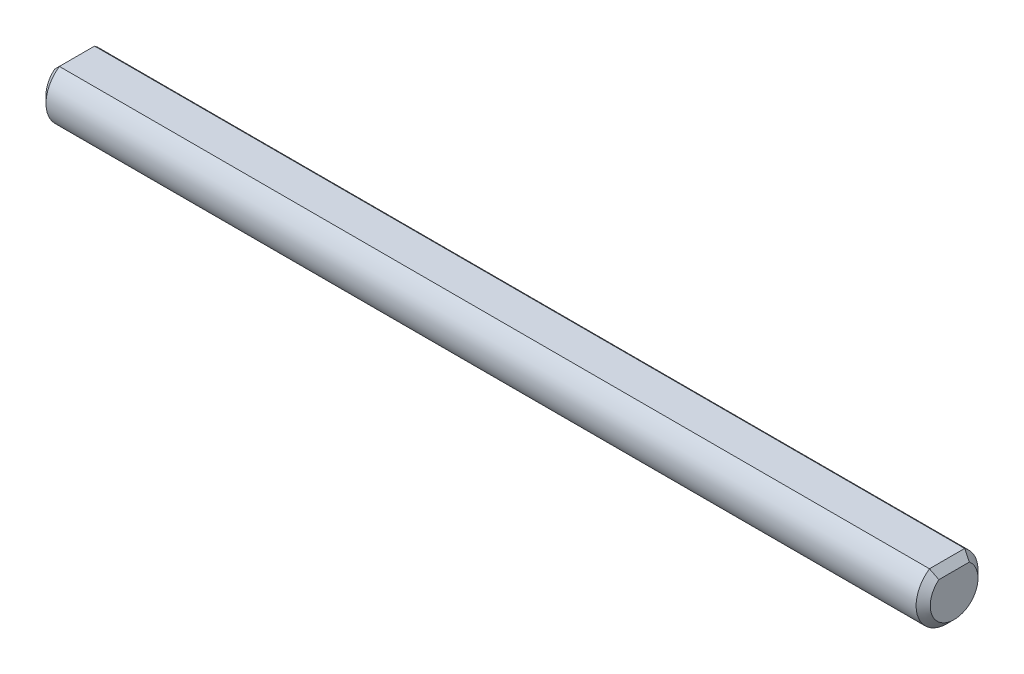
ISO-10303-21;
HEADER;
FILE_DESCRIPTION(('STEP AP214'),'2;1');
FILE_NAME('part.step','',(''),(''),'','','');
FILE_SCHEMA(('AUTOMOTIVE_DESIGN { 1 0 10303 214 1 1 1 1 }'));
ENDSEC;
DATA;
#1=APPLICATION_CONTEXT('core data for automotive mechanical design processes');
#2=APPLICATION_PROTOCOL_DEFINITION('international standard','automotive_design',2000,#1);
#3=PRODUCT_CONTEXT('',#1,'mechanical');
#4=PRODUCT('Part','Part','',(#3));
#5=PRODUCT_RELATED_PRODUCT_CATEGORY('part','',(#4));
#6=PRODUCT_DEFINITION_FORMATION('','',#4);
#7=PRODUCT_DEFINITION_CONTEXT('part definition',#1,'design');
#8=PRODUCT_DEFINITION('design','',#6,#7);
#9=PRODUCT_DEFINITION_SHAPE('','',#8);
#10=(LENGTH_UNIT() NAMED_UNIT(*) SI_UNIT(.MILLI.,.METRE.));
#11=(NAMED_UNIT(*) PLANE_ANGLE_UNIT() SI_UNIT($,.RADIAN.));
#12=(NAMED_UNIT(*) SI_UNIT($,.STERADIAN.) SOLID_ANGLE_UNIT());
#13=UNCERTAINTY_MEASURE_WITH_UNIT(LENGTH_MEASURE(1.E-05),#10,'distance_accuracy_value','');
#14=(GEOMETRIC_REPRESENTATION_CONTEXT(3) GLOBAL_UNCERTAINTY_ASSIGNED_CONTEXT((#13)) GLOBAL_UNIT_ASSIGNED_CONTEXT((#10,
#11,#12)) REPRESENTATION_CONTEXT('',''));
#15=CARTESIAN_POINT('',(0.,0.,0.));
#16=DIRECTION('',(0.,0.,1.));
#17=DIRECTION('',(1.,0.,0.));
#18=AXIS2_PLACEMENT_3D('',#15,#16,#17);
#19=CARTESIAN_POINT('',(25.,0.,0.));
#20=DIRECTION('',(-1.,0.,0.));
#21=DIRECTION('',(0.,0.,1.));
#22=AXIS2_PLACEMENT_3D('',#19,#20,#21);
#23=CYLINDRICAL_SURFACE('',#22,1.75);
#24=DIRECTION('',(-1.,0.,0.));
#25=VECTOR('',#24,1.);
#26=CARTESIAN_POINT('',(25.,1.43923133145753,0.995546671206827));
#27=LINE('',#26,#25);
#28=CARTESIAN_POINT('',(24.6,1.43923133145753,0.995546671206827));
#29=VERTEX_POINT('',#28);
#30=CARTESIAN_POINT('',(-24.6,1.43923133145753,0.995546671206827));
#31=VERTEX_POINT('',#30);
#32=EDGE_CURVE('E89',#29,#31,#27,.T.);
#33=ORIENTED_EDGE('',*,*,#32,.T.);
#34=CARTESIAN_POINT('',(-24.6,0.,0.));
#35=DIRECTION('',(1.,0.,0.));
#36=DIRECTION('',(0.,0.,-1.));
#37=AXIS2_PLACEMENT_3D('',#34,#35,#36);
#38=CIRCLE('',#37,1.75);
#39=CARTESIAN_POINT('',(-24.6,1.43923133145753,-0.995546671206827));
#40=VERTEX_POINT('',#39);
#41=EDGE_CURVE('E94',#31,#40,#38,.T.);
#42=ORIENTED_EDGE('',*,*,#41,.T.);
#43=DIRECTION('',(-1.,0.,0.));
#44=VECTOR('',#43,1.);
#45=CARTESIAN_POINT('',(25.,1.43923133145753,-0.995546671206827));
#46=LINE('',#45,#44);
#47=CARTESIAN_POINT('',(24.6,1.43923133145753,-0.995546671206827));
#48=VERTEX_POINT('',#47);
#49=EDGE_CURVE('E91',#48,#40,#46,.T.);
#50=ORIENTED_EDGE('',*,*,#49,.F.);
#51=CARTESIAN_POINT('',(24.6,0.,0.));
#52=DIRECTION('',(1.,0.,0.));
#53=DIRECTION('',(0.,0.,-1.));
#54=AXIS2_PLACEMENT_3D('',#51,#52,#53);
#55=CIRCLE('',#54,1.75);
#56=EDGE_CURVE('E87',#48,#29,#55,.F.);
#57=ORIENTED_EDGE('',*,*,#56,.T.);
#58=EDGE_LOOP('',(#33,#42,#50,#57));
#59=FACE_BOUND('',#58,.T.);
#60=ADVANCED_FACE('F37',(#59),#23,.T.);
#61=CARTESIAN_POINT('',(25.,1.43923133145753,-0.995546671206827));
#62=DIRECTION('',(0.,-1.,0.));
#63=DIRECTION('',(0.,0.,-1.));
#64=AXIS2_PLACEMENT_3D('',#61,#62,#63);
#65=PLANE('',#64);
#66=ORIENTED_EDGE('',*,*,#49,.T.);
#67=DIRECTION('',(0.,0.,1.));
#68=VECTOR('',#67,1.);
#69=CARTESIAN_POINT('',(-24.6,1.43923133145753,-0.995546671206827));
#70=LINE('',#69,#68);
#71=EDGE_CURVE('E102',#40,#31,#70,.T.);
#72=ORIENTED_EDGE('',*,*,#71,.T.);
#73=ORIENTED_EDGE('',*,*,#32,.F.);
#74=DIRECTION('',(0.,0.,-1.));
#75=VECTOR('',#74,1.);
#76=CARTESIAN_POINT('',(24.6,1.43923133145753,-0.995546671206827));
#77=LINE('',#76,#75);
#78=EDGE_CURVE('E100',#29,#48,#77,.T.);
#79=ORIENTED_EDGE('',*,*,#78,.T.);
#80=EDGE_LOOP('',(#66,#72,#73,#79));
#81=FACE_BOUND('',#80,.T.);
#82=ADVANCED_FACE('F99',(#81),#65,.F.);
#83=CARTESIAN_POINT('',(25.,0.,0.));
#84=DIRECTION('',(1.,0.,0.));
#85=DIRECTION('',(0.,0.,-1.));
#86=AXIS2_PLACEMENT_3D('',#83,#84,#85);
#87=PLANE('',#86);
#88=CARTESIAN_POINT('',(25.,0.,0.));
#89=DIRECTION('',(1.,0.,0.));
#90=DIRECTION('',(0.,0.,-1.));
#91=AXIS2_PLACEMENT_3D('',#88,#89,#90);
#92=CIRCLE('',#91,1.35);
#93=CARTESIAN_POINT('',(25.,1.03923133145753,0.861683375560314));
#94=VERTEX_POINT('',#93);
#95=CARTESIAN_POINT('',(25.,1.03923133145753,-0.861683375560314));
#96=VERTEX_POINT('',#95);
#97=EDGE_CURVE('E52',#94,#96,#92,.T.);
#98=ORIENTED_EDGE('',*,*,#97,.T.);
#99=DIRECTION('',(0.,0.,1.));
#100=VECTOR('',#99,1.);
#101=CARTESIAN_POINT('',(25.,1.03923133145753,0.995546671206827));
#102=LINE('',#101,#100);
#103=EDGE_CURVE('E11',#96,#94,#102,.T.);
#104=ORIENTED_EDGE('',*,*,#103,.T.);
#105=EDGE_LOOP('',(#98,#104));
#106=FACE_BOUND('',#105,.T.);
#107=ADVANCED_FACE('F159',(#106),#87,.T.);
#108=CARTESIAN_POINT('',(-25.,0.,0.));
#109=DIRECTION('',(1.,0.,0.));
#110=DIRECTION('',(0.,0.,-1.));
#111=AXIS2_PLACEMENT_3D('',#108,#109,#110);
#112=PLANE('',#111);
#113=CARTESIAN_POINT('',(-25.,0.,0.));
#114=DIRECTION('',(1.,0.,0.));
#115=DIRECTION('',(0.,0.,-1.));
#116=AXIS2_PLACEMENT_3D('',#113,#114,#115);
#117=CIRCLE('',#116,1.34999999999999);
#118=CARTESIAN_POINT('',(-25.,1.03923133145752,-0.861683375560309));
#119=VERTEX_POINT('',#118);
#120=CARTESIAN_POINT('',(-25.,1.03923133145752,0.861683375560309));
#121=VERTEX_POINT('',#120);
#122=EDGE_CURVE('E147',#119,#121,#117,.F.);
#123=ORIENTED_EDGE('',*,*,#122,.T.);
#124=DIRECTION('',(0.,0.,-1.));
#125=VECTOR('',#124,1.);
#126=CARTESIAN_POINT('',(-25.,1.03923133145752,0.));
#127=LINE('',#126,#125);
#128=EDGE_CURVE('E95',#121,#119,#127,.T.);
#129=ORIENTED_EDGE('',*,*,#128,.T.);
#130=EDGE_LOOP('',(#123,#129));
#131=FACE_BOUND('',#130,.T.);
#132=ADVANCED_FACE('F157',(#131),#112,.F.);
#133=CARTESIAN_POINT('',(-24.6,0.,0.));
#134=DIRECTION('',(1.,0.,0.));
#135=DIRECTION('',(0.,0.,-1.));
#136=AXIS2_PLACEMENT_3D('',#133,#134,#135);
#137=CONICAL_SURFACE('',#136,1.75,0.785398163397446);
#138=CARTESIAN_POINT('',(-24.6,1.43923133145753,0.995546671206827));
#139=CARTESIAN_POINT('',(-24.6334507451215,1.40578058633598,0.985103875700533));
#140=CARTESIAN_POINT('',(-24.666877458675,1.37235387278255,0.974505988646356));
#141=CARTESIAN_POINT('',(-24.7336732743098,1.30555805714769,0.95296727222749));
#142=CARTESIAN_POINT('',(-24.7670423800024,1.27218895145513,0.942026465247995));
#143=CARTESIAN_POINT('',(-24.8337184630385,1.20551286841906,0.919767573801417));
#144=CARTESIAN_POINT('',(-24.8670254391172,1.17220589234028,0.908449481740782));
#145=CARTESIAN_POINT('',(-24.9335687513942,1.10566258006333,0.885392563202528));
#146=CARTESIAN_POINT('',(-24.9668050828438,1.07242624861377,0.873653709333867));
#147=CARTESIAN_POINT('',(-25.,1.03923133145752,0.861683375560309));
#148=B_SPLINE_CURVE_WITH_KNOTS('',3,(#138,#139,#140,#141,#142,#143,#144,#145,#146,#147),
.UNSPECIFIED.,.F.,.F.,(4,2,2,2,4),(0.,0.145336284535562,0.290663101459312,0.435992845118985,
0.581332066798329),.UNSPECIFIED.);
#149=EDGE_CURVE('E107',#121,#31,#148,.F.);
#150=ORIENTED_EDGE('',*,*,#149,.F.);
#151=ORIENTED_EDGE('',*,*,#122,.F.);
#152=CARTESIAN_POINT('',(-25.,1.03923133145752,-0.861683375560309));
#153=CARTESIAN_POINT('',(-24.9668050828438,1.07242624861377,-0.873653709333867));
#154=CARTESIAN_POINT('',(-24.9335687513942,1.10566258006333,-0.885392563202528));
#155=CARTESIAN_POINT('',(-24.8670254391172,1.17220589234028,-0.908449481740782));
#156=CARTESIAN_POINT('',(-24.8337184630385,1.20551286841906,-0.919767573801417));
#157=CARTESIAN_POINT('',(-24.7670423800024,1.27218895145513,-0.942026465247995));
#158=CARTESIAN_POINT('',(-24.7336732743098,1.30555805714769,-0.95296727222749));
#159=CARTESIAN_POINT('',(-24.666877458675,1.37235387278255,-0.974505988646357));
#160=CARTESIAN_POINT('',(-24.6334507451215,1.40578058633598,-0.985103875700534));
#161=CARTESIAN_POINT('',(-24.6,1.43923133145753,-0.995546671206827));
#162=B_SPLINE_CURVE_WITH_KNOTS('',3,(#152,#153,#154,#155,#156,#157,#158,#159,#160,#161),
.UNSPECIFIED.,.F.,.F.,(4,2,2,2,4),(0.,0.145339221679344,0.290668965339016,0.435995782262767,
0.58133206679833),.UNSPECIFIED.);
#163=EDGE_CURVE('E103',#40,#119,#162,.F.);
#164=ORIENTED_EDGE('',*,*,#163,.F.);
#165=ORIENTED_EDGE('',*,*,#41,.F.);
#166=EDGE_LOOP('',(#150,#151,#164,#165));
#167=FACE_BOUND('',#166,.T.);
#168=ADVANCED_FACE('F133',(#167),#137,.T.);
#169=CARTESIAN_POINT('',(-24.6,1.43923133145753,-0.995546671206827));
#170=DIRECTION('',(0.707106781186546,-0.707106781186549,0.));
#171=DIRECTION('',(0.,0.,1.));
#172=AXIS2_PLACEMENT_3D('',#169,#170,#171);
#173=PLANE('',#172);
#174=ORIENTED_EDGE('',*,*,#163,.T.);
#175=ORIENTED_EDGE('',*,*,#128,.F.);
#176=ORIENTED_EDGE('',*,*,#149,.T.);
#177=ORIENTED_EDGE('',*,*,#71,.F.);
#178=EDGE_LOOP('',(#174,#175,#176,#177));
#179=FACE_BOUND('',#178,.T.);
#180=ADVANCED_FACE('F125',(#179),#173,.F.);
#181=CARTESIAN_POINT('',(25.,0.,0.));
#182=DIRECTION('',(-1.,0.,0.));
#183=DIRECTION('',(0.,0.,1.));
#184=AXIS2_PLACEMENT_3D('',#181,#182,#183);
#185=CONICAL_SURFACE('',#184,1.35,0.785398163397451);
#186=CARTESIAN_POINT('',(25.,1.03923133145753,0.861683375560314));
#187=CARTESIAN_POINT('',(24.9668050828438,1.07242624861378,0.873653709333872));
#188=CARTESIAN_POINT('',(24.9335687513942,1.10566258006334,0.885392563202532));
#189=CARTESIAN_POINT('',(24.8670254391172,1.17220589234029,0.908449481740786));
#190=CARTESIAN_POINT('',(24.8337184630385,1.20551286841906,0.91976757380142));
#191=CARTESIAN_POINT('',(24.7670423800024,1.27218895145513,0.942026465247997));
#192=CARTESIAN_POINT('',(24.7336732743098,1.30555805714769,0.952967272227492));
#193=CARTESIAN_POINT('',(24.666877458675,1.37235387278255,0.974505988646357));
#194=CARTESIAN_POINT('',(24.6334507451216,1.40578058633598,0.985103875700534));
#195=CARTESIAN_POINT('',(24.6,1.43923133145753,0.995546671206827));
#196=B_SPLINE_CURVE_WITH_KNOTS('',3,(#186,#187,#188,#189,#190,#191,#192,#193,#194,#195),
.UNSPECIFIED.,.F.,.F.,(4,2,2,2,4),(0.,0.145339221679339,0.290668965339007,0.435995782262749,
0.581332066798307),.UNSPECIFIED.);
#197=EDGE_CURVE('E65',#29,#94,#196,.F.);
#198=ORIENTED_EDGE('',*,*,#197,.F.);
#199=ORIENTED_EDGE('',*,*,#56,.F.);
#200=CARTESIAN_POINT('',(24.6,1.43923133145753,-0.995546671206827));
#201=CARTESIAN_POINT('',(24.6334507451216,1.40578058633598,-0.985103875700534));
#202=CARTESIAN_POINT('',(24.666877458675,1.37235387278255,-0.974505988646357));
#203=CARTESIAN_POINT('',(24.7336732743098,1.30555805714769,-0.952967272227491));
#204=CARTESIAN_POINT('',(24.7670423800024,1.27218895145513,-0.942026465247997));
#205=CARTESIAN_POINT('',(24.8337184630385,1.20551286841906,-0.919767573801419));
#206=CARTESIAN_POINT('',(24.8670254391172,1.17220589234029,-0.908449481740785));
#207=CARTESIAN_POINT('',(24.9335687513942,1.10566258006334,-0.885392563202532));
#208=CARTESIAN_POINT('',(24.9668050828438,1.07242624861378,-0.873653709333872));
#209=CARTESIAN_POINT('',(25.,1.03923133145753,-0.861683375560314));
#210=B_SPLINE_CURVE_WITH_KNOTS('',3,(#200,#201,#202,#203,#204,#205,#206,#207,#208,#209),
.UNSPECIFIED.,.F.,.F.,(4,2,2,2,4),(0.,0.145336284535557,0.290663101459299,0.435992845118967,
0.581332066798306),.UNSPECIFIED.);
#211=EDGE_CURVE('E43',#96,#48,#210,.F.);
#212=ORIENTED_EDGE('',*,*,#211,.F.);
#213=ORIENTED_EDGE('',*,*,#97,.F.);
#214=EDGE_LOOP('',(#198,#199,#212,#213));
#215=FACE_BOUND('',#214,.T.);
#216=ADVANCED_FACE('F106',(#215),#185,.T.);
#217=CARTESIAN_POINT('',(25.,1.03923133145753,0.));
#218=DIRECTION('',(0.707106781186549,0.707106781186546,0.));
#219=DIRECTION('',(0.,0.,-1.));
#220=AXIS2_PLACEMENT_3D('',#217,#218,#219);
#221=PLANE('',#220);
#222=ORIENTED_EDGE('',*,*,#211,.T.);
#223=ORIENTED_EDGE('',*,*,#78,.F.);
#224=ORIENTED_EDGE('',*,*,#197,.T.);
#225=ORIENTED_EDGE('',*,*,#103,.F.);
#226=EDGE_LOOP('',(#222,#223,#224,#225));
#227=FACE_BOUND('',#226,.T.);
#228=ADVANCED_FACE('F40',(#227),#221,.T.);
#229=CLOSED_SHELL('',(#60,#82,#107,#132,#168,#180,#216,#228));
#230=MANIFOLD_SOLID_BREP('B2',#229);
#231=ADVANCED_BREP_SHAPE_REPRESENTATION('',(#18,#230),#14);
#232=SHAPE_DEFINITION_REPRESENTATION(#9,#231);
ENDSEC;
END-ISO-10303-21;
